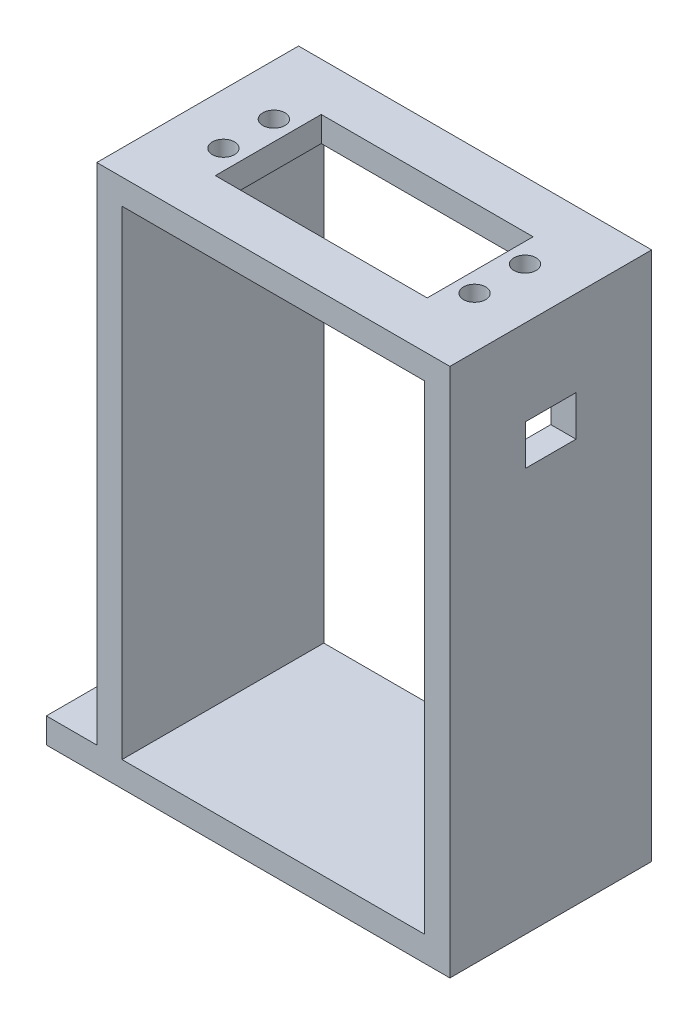
ISO-10303-21;
HEADER;
FILE_DESCRIPTION(('STEP AP214'),'2;1');
FILE_NAME('part.step','',(''),(''),'','','');
FILE_SCHEMA(('AUTOMOTIVE_DESIGN { 1 0 10303 214 1 1 1 1 }'));
ENDSEC;
DATA;
#1=APPLICATION_CONTEXT('core data for automotive mechanical design processes');
#2=APPLICATION_PROTOCOL_DEFINITION('international standard','automotive_design',2000,#1);
#3=PRODUCT_CONTEXT('',#1,'mechanical');
#4=PRODUCT('Part','Part','',(#3));
#5=PRODUCT_RELATED_PRODUCT_CATEGORY('part','',(#4));
#6=PRODUCT_DEFINITION_FORMATION('','',#4);
#7=PRODUCT_DEFINITION_CONTEXT('part definition',#1,'design');
#8=PRODUCT_DEFINITION('design','',#6,#7);
#9=PRODUCT_DEFINITION_SHAPE('','',#8);
#10=(LENGTH_UNIT() NAMED_UNIT(*) SI_UNIT(.MILLI.,.METRE.));
#11=(NAMED_UNIT(*) PLANE_ANGLE_UNIT() SI_UNIT($,.RADIAN.));
#12=(NAMED_UNIT(*) SI_UNIT($,.STERADIAN.) SOLID_ANGLE_UNIT());
#13=UNCERTAINTY_MEASURE_WITH_UNIT(LENGTH_MEASURE(1.E-05),#10,'distance_accuracy_value','');
#14=(GEOMETRIC_REPRESENTATION_CONTEXT(3) GLOBAL_UNCERTAINTY_ASSIGNED_CONTEXT((#13)) GLOBAL_UNIT_ASSIGNED_CONTEXT((#10,
#11,#12)) REPRESENTATION_CONTEXT('',''));
#15=CARTESIAN_POINT('',(0.,0.,0.));
#16=DIRECTION('',(0.,0.,1.));
#17=DIRECTION('',(1.,0.,0.));
#18=AXIS2_PLACEMENT_3D('',#15,#16,#17);
#19=CARTESIAN_POINT('',(-75.,5.,-25.));
#20=DIRECTION('',(0.,-1.,0.));
#21=DIRECTION('',(0.,0.,-1.));
#22=AXIS2_PLACEMENT_3D('',#19,#20,#21);
#23=CYLINDRICAL_SURFACE('',#22,2.2);
#24=CARTESIAN_POINT('',(-75.,5.,-25.));
#25=DIRECTION('',(0.,1.,0.));
#26=DIRECTION('',(0.,0.,1.));
#27=AXIS2_PLACEMENT_3D('',#24,#25,#26);
#28=CIRCLE('',#27,2.2);
#29=CARTESIAN_POINT('',(-75.,5.,-22.8));
#30=VERTEX_POINT('',#29);
#31=EDGE_CURVE('E263',#30,#30,#28,.T.);
#32=ORIENTED_EDGE('',*,*,#31,.T.);
#33=EDGE_LOOP('',(#32));
#34=FACE_BOUND('',#33,.T.);
#35=CARTESIAN_POINT('',(-75.,3.,-25.));
#36=DIRECTION('',(0.,-1.,0.));
#37=DIRECTION('',(0.,0.,-1.));
#38=AXIS2_PLACEMENT_3D('',#35,#36,#37);
#39=CIRCLE('',#38,2.2);
#40=CARTESIAN_POINT('',(-75.,3.,-27.2));
#41=VERTEX_POINT('',#40);
#42=EDGE_CURVE('E424',#41,#41,#39,.T.);
#43=ORIENTED_EDGE('',*,*,#42,.T.);
#44=EDGE_LOOP('',(#43));
#45=FACE_BOUND('',#44,.T.);
#46=ADVANCED_FACE('F40',(#34,#45),#23,.F.);
#47=CARTESIAN_POINT('',(-75.,5.,-15.));
#48=DIRECTION('',(0.,-1.,0.));
#49=DIRECTION('',(0.,0.,-1.));
#50=AXIS2_PLACEMENT_3D('',#47,#48,#49);
#51=CYLINDRICAL_SURFACE('',#50,2.2);
#52=CARTESIAN_POINT('',(-75.,5.,-15.));
#53=DIRECTION('',(0.,1.,0.));
#54=DIRECTION('',(0.,0.,1.));
#55=AXIS2_PLACEMENT_3D('',#52,#53,#54);
#56=CIRCLE('',#55,2.2);
#57=CARTESIAN_POINT('',(-75.,5.,-12.8));
#58=VERTEX_POINT('',#57);
#59=EDGE_CURVE('E260',#58,#58,#56,.T.);
#60=ORIENTED_EDGE('',*,*,#59,.T.);
#61=EDGE_LOOP('',(#60));
#62=FACE_BOUND('',#61,.T.);
#63=CARTESIAN_POINT('',(-75.,3.,-15.));
#64=DIRECTION('',(0.,-1.,0.));
#65=DIRECTION('',(0.,0.,-1.));
#66=AXIS2_PLACEMENT_3D('',#63,#64,#65);
#67=CIRCLE('',#66,2.2);
#68=CARTESIAN_POINT('',(-75.,3.,-17.2));
#69=VERTEX_POINT('',#68);
#70=EDGE_CURVE('E427',#69,#69,#67,.T.);
#71=ORIENTED_EDGE('',*,*,#70,.T.);
#72=EDGE_LOOP('',(#71));
#73=FACE_BOUND('',#72,.T.);
#74=ADVANCED_FACE('F397',(#62,#73),#51,.F.);
#75=CARTESIAN_POINT('',(0.,5.,0.));
#76=DIRECTION('',(-1.,0.,0.));
#77=DIRECTION('',(0.,0.,1.));
#78=AXIS2_PLACEMENT_3D('',#75,#76,#77);
#79=PLANE('',#78);
#80=DIRECTION('',(0.,0.,-1.));
#81=VECTOR('',#80,1.);
#82=CARTESIAN_POINT('',(0.,0.,0.));
#83=LINE('',#82,#81);
#84=CARTESIAN_POINT('',(0.,0.,0.));
#85=VERTEX_POINT('',#84);
#86=CARTESIAN_POINT('',(0.,0.,-40.));
#87=VERTEX_POINT('',#86);
#88=EDGE_CURVE('E266',#85,#87,#83,.T.);
#89=ORIENTED_EDGE('',*,*,#88,.T.);
#90=DIRECTION('',(0.,-1.,0.));
#91=VECTOR('',#90,1.);
#92=CARTESIAN_POINT('',(0.,5.,-40.));
#93=LINE('',#92,#91);
#94=CARTESIAN_POINT('',(0.,105.,-40.));
#95=VERTEX_POINT('',#94);
#96=EDGE_CURVE('E294',#95,#87,#93,.T.);
#97=ORIENTED_EDGE('',*,*,#96,.F.);
#98=DIRECTION('',(0.,0.,-1.));
#99=VECTOR('',#98,1.);
#100=CARTESIAN_POINT('',(0.,105.,0.));
#101=LINE('',#100,#99);
#102=CARTESIAN_POINT('',(0.,105.,0.));
#103=VERTEX_POINT('',#102);
#104=EDGE_CURVE('E249',#103,#95,#101,.T.);
#105=ORIENTED_EDGE('',*,*,#104,.F.);
#106=DIRECTION('',(0.,-1.,0.));
#107=VECTOR('',#106,1.);
#108=CARTESIAN_POINT('',(0.,5.,0.));
#109=LINE('',#108,#107);
#110=EDGE_CURVE('E277',#103,#85,#109,.T.);
#111=ORIENTED_EDGE('',*,*,#110,.T.);
#112=EDGE_LOOP('',(#89,#97,#105,#111));
#113=FACE_BOUND('',#112,.T.);
#114=DIRECTION('',(0.,-1.,0.));
#115=VECTOR('',#114,1.);
#116=CARTESIAN_POINT('',(0.,0.,-25.));
#117=LINE('',#116,#115);
#118=CARTESIAN_POINT('',(0.,88.,-25.));
#119=VERTEX_POINT('',#118);
#120=CARTESIAN_POINT('',(0.,80.,-25.));
#121=VERTEX_POINT('',#120);
#122=EDGE_CURVE('E207',#119,#121,#117,.T.);
#123=ORIENTED_EDGE('',*,*,#122,.T.);
#124=DIRECTION('',(0.,0.,-1.));
#125=VECTOR('',#124,1.);
#126=CARTESIAN_POINT('',(0.,80.,0.));
#127=LINE('',#126,#125);
#128=CARTESIAN_POINT('',(0.,80.,-15.));
#129=VERTEX_POINT('',#128);
#130=EDGE_CURVE('E216',#129,#121,#127,.T.);
#131=ORIENTED_EDGE('',*,*,#130,.F.);
#132=DIRECTION('',(0.,-1.,0.));
#133=VECTOR('',#132,1.);
#134=CARTESIAN_POINT('',(0.,0.,-15.));
#135=LINE('',#134,#133);
#136=CARTESIAN_POINT('',(0.,88.,-15.));
#137=VERTEX_POINT('',#136);
#138=EDGE_CURVE('E213',#137,#129,#135,.T.);
#139=ORIENTED_EDGE('',*,*,#138,.F.);
#140=DIRECTION('',(0.,0.,-1.));
#141=VECTOR('',#140,1.);
#142=CARTESIAN_POINT('',(0.,88.,0.));
#143=LINE('',#142,#141);
#144=EDGE_CURVE('E210',#137,#119,#143,.T.);
#145=ORIENTED_EDGE('',*,*,#144,.T.);
#146=EDGE_LOOP('',(#123,#131,#139,#145));
#147=FACE_BOUND('',#146,.T.);
#148=ADVANCED_FACE('F42',(#113,#147),#79,.F.);
#149=CARTESIAN_POINT('',(-5.,105.,0.));
#150=DIRECTION('',(-1.,0.,0.));
#151=DIRECTION('',(0.,0.,1.));
#152=AXIS2_PLACEMENT_3D('',#149,#150,#151);
#153=PLANE('',#152);
#154=DIRECTION('',(0.,0.,1.));
#155=VECTOR('',#154,1.);
#156=CARTESIAN_POINT('',(-5.,100.,0.));
#157=LINE('',#156,#155);
#158=CARTESIAN_POINT('',(-5.,100.,-40.));
#159=VERTEX_POINT('',#158);
#160=CARTESIAN_POINT('',(-5.,100.,0.));
#161=VERTEX_POINT('',#160);
#162=EDGE_CURVE('E204',#159,#161,#157,.T.);
#163=ORIENTED_EDGE('',*,*,#162,.F.);
#164=DIRECTION('',(0.,-1.,0.));
#165=VECTOR('',#164,1.);
#166=CARTESIAN_POINT('',(-5.,105.,-40.));
#167=LINE('',#166,#165);
#168=CARTESIAN_POINT('',(-5.,5.,-40.));
#169=VERTEX_POINT('',#168);
#170=EDGE_CURVE('E254',#159,#169,#167,.T.);
#171=ORIENTED_EDGE('',*,*,#170,.T.);
#172=DIRECTION('',(0.,0.,-1.));
#173=VECTOR('',#172,1.);
#174=CARTESIAN_POINT('',(-5.,5.,0.));
#175=LINE('',#174,#173);
#176=CARTESIAN_POINT('',(-5.,5.,0.));
#177=VERTEX_POINT('',#176);
#178=EDGE_CURVE('E245',#177,#169,#175,.T.);
#179=ORIENTED_EDGE('',*,*,#178,.F.);
#180=DIRECTION('',(0.,-1.,0.));
#181=VECTOR('',#180,1.);
#182=CARTESIAN_POINT('',(-5.,105.,0.));
#183=LINE('',#182,#181);
#184=EDGE_CURVE('E258',#161,#177,#183,.T.);
#185=ORIENTED_EDGE('',*,*,#184,.F.);
#186=EDGE_LOOP('',(#163,#171,#179,#185));
#187=FACE_BOUND('',#186,.T.);
#188=DIRECTION('',(0.,0.,1.));
#189=VECTOR('',#188,1.);
#190=CARTESIAN_POINT('',(-5.,80.,0.));
#191=LINE('',#190,#189);
#192=CARTESIAN_POINT('',(-5.,80.,-25.));
#193=VERTEX_POINT('',#192);
#194=CARTESIAN_POINT('',(-5.,80.,-15.));
#195=VERTEX_POINT('',#194);
#196=EDGE_CURVE('E302',#193,#195,#191,.T.);
#197=ORIENTED_EDGE('',*,*,#196,.F.);
#198=DIRECTION('',(0.,1.,0.));
#199=VECTOR('',#198,1.);
#200=CARTESIAN_POINT('',(-5.,105.,-25.));
#201=LINE('',#200,#199);
#202=CARTESIAN_POINT('',(-5.,88.,-25.));
#203=VERTEX_POINT('',#202);
#204=EDGE_CURVE('E304',#193,#203,#201,.T.);
#205=ORIENTED_EDGE('',*,*,#204,.T.);
#206=DIRECTION('',(0.,0.,1.));
#207=VECTOR('',#206,1.);
#208=CARTESIAN_POINT('',(-5.,88.,0.));
#209=LINE('',#208,#207);
#210=CARTESIAN_POINT('',(-5.,88.,-15.));
#211=VERTEX_POINT('',#210);
#212=EDGE_CURVE('E296',#203,#211,#209,.T.);
#213=ORIENTED_EDGE('',*,*,#212,.T.);
#214=DIRECTION('',(0.,1.,0.));
#215=VECTOR('',#214,1.);
#216=CARTESIAN_POINT('',(-5.,105.,-15.));
#217=LINE('',#216,#215);
#218=EDGE_CURVE('E299',#195,#211,#217,.T.);
#219=ORIENTED_EDGE('',*,*,#218,.F.);
#220=EDGE_LOOP('',(#197,#205,#213,#219));
#221=FACE_BOUND('',#220,.T.);
#222=ADVANCED_FACE('F356',(#187,#221),#153,.T.);
#223=CARTESIAN_POINT('',(0.,5.,0.));
#224=DIRECTION('',(0.,1.,0.));
#225=DIRECTION('',(0.,0.,1.));
#226=AXIS2_PLACEMENT_3D('',#223,#224,#225);
#227=PLANE('',#226);
#228=DIRECTION('',(-1.,0.,0.));
#229=VECTOR('',#228,1.);
#230=CARTESIAN_POINT('',(0.,5.,-40.));
#231=LINE('',#230,#229);
#232=CARTESIAN_POINT('',(-65.,5.,-40.));
#233=VERTEX_POINT('',#232);
#234=EDGE_CURVE('E267',#169,#233,#231,.T.);
#235=ORIENTED_EDGE('',*,*,#234,.T.);
#236=DIRECTION('',(0.,0.,-1.));
#237=VECTOR('',#236,1.);
#238=CARTESIAN_POINT('',(-65.,5.,0.));
#239=LINE('',#238,#237);
#240=CARTESIAN_POINT('',(-65.,5.,0.));
#241=VERTEX_POINT('',#240);
#242=EDGE_CURVE('E222',#241,#233,#239,.T.);
#243=ORIENTED_EDGE('',*,*,#242,.F.);
#244=DIRECTION('',(1.,0.,0.));
#245=VECTOR('',#244,1.);
#246=CARTESIAN_POINT('',(0.,5.,0.));
#247=LINE('',#246,#245);
#248=EDGE_CURVE('E273',#241,#177,#247,.T.);
#249=ORIENTED_EDGE('',*,*,#248,.T.);
#250=ORIENTED_EDGE('',*,*,#178,.T.);
#251=EDGE_LOOP('',(#235,#243,#249,#250));
#252=FACE_BOUND('',#251,.T.);
#253=ADVANCED_FACE('F353',(#252),#227,.T.);
#254=DIRECTION('',(0.,0.,-1.));
#255=VECTOR('',#254,1.);
#256=CARTESIAN_POINT('',(-70.,5.,0.));
#257=LINE('',#256,#255);
#258=CARTESIAN_POINT('',(-70.,5.,0.));
#259=VERTEX_POINT('',#258);
#260=CARTESIAN_POINT('',(-70.,5.,-40.));
#261=VERTEX_POINT('',#260);
#262=EDGE_CURVE('E233',#259,#261,#257,.T.);
#263=ORIENTED_EDGE('',*,*,#262,.T.);
#264=CARTESIAN_POINT('',(-80.,5.,-40.));
#265=VERTEX_POINT('',#264);
#266=EDGE_CURVE('E271',#261,#265,#231,.T.);
#267=ORIENTED_EDGE('',*,*,#266,.T.);
#268=DIRECTION('',(0.,0.,1.));
#269=VECTOR('',#268,1.);
#270=CARTESIAN_POINT('',(-80.,5.,0.));
#271=LINE('',#270,#269);
#272=CARTESIAN_POINT('',(-80.,5.,0.));
#273=VERTEX_POINT('',#272);
#274=EDGE_CURVE('E270',#265,#273,#271,.T.);
#275=ORIENTED_EDGE('',*,*,#274,.T.);
#276=EDGE_CURVE('E274',#273,#259,#247,.T.);
#277=ORIENTED_EDGE('',*,*,#276,.T.);
#278=EDGE_LOOP('',(#263,#267,#275,#277));
#279=FACE_BOUND('',#278,.T.);
#280=ORIENTED_EDGE('',*,*,#31,.F.);
#281=EDGE_LOOP('',(#280));
#282=FACE_BOUND('',#281,.T.);
#283=ORIENTED_EDGE('',*,*,#59,.F.);
#284=EDGE_LOOP('',(#283));
#285=FACE_BOUND('',#284,.T.);
#286=ADVANCED_FACE('F385',(#279,#282,#285),#227,.T.);
#287=CARTESIAN_POINT('',(0.,0.,0.));
#288=DIRECTION('',(0.,1.,0.));
#289=DIRECTION('',(0.,0.,1.));
#290=AXIS2_PLACEMENT_3D('',#287,#288,#289);
#291=PLANE('',#290);
#292=CARTESIAN_POINT('',(-75.,0.,-15.));
#293=DIRECTION('',(0.,-1.,0.));
#294=DIRECTION('',(0.,0.,-1.));
#295=AXIS2_PLACEMENT_3D('',#292,#293,#294);
#296=CIRCLE('',#295,4.00000000000001);
#297=CARTESIAN_POINT('',(-75.,0.,-19.));
#298=VERTEX_POINT('',#297);
#299=EDGE_CURVE('E418',#298,#298,#296,.T.);
#300=ORIENTED_EDGE('',*,*,#299,.F.);
#301=EDGE_LOOP('',(#300));
#302=FACE_BOUND('',#301,.T.);
#303=CARTESIAN_POINT('',(-75.,0.,-25.));
#304=DIRECTION('',(0.,-1.,0.));
#305=DIRECTION('',(0.,0.,-1.));
#306=AXIS2_PLACEMENT_3D('',#303,#304,#305);
#307=CIRCLE('',#306,4.00000000000001);
#308=CARTESIAN_POINT('',(-75.,0.,-29.));
#309=VERTEX_POINT('',#308);
#310=EDGE_CURVE('E421',#309,#309,#307,.T.);
#311=ORIENTED_EDGE('',*,*,#310,.F.);
#312=EDGE_LOOP('',(#311));
#313=FACE_BOUND('',#312,.T.);
#314=ORIENTED_EDGE('',*,*,#88,.F.);
#315=DIRECTION('',(1.,0.,0.));
#316=VECTOR('',#315,1.);
#317=CARTESIAN_POINT('',(0.,0.,0.));
#318=LINE('',#317,#316);
#319=CARTESIAN_POINT('',(-80.,0.,0.));
#320=VERTEX_POINT('',#319);
#321=EDGE_CURVE('E284',#320,#85,#318,.T.);
#322=ORIENTED_EDGE('',*,*,#321,.F.);
#323=DIRECTION('',(0.,0.,1.));
#324=VECTOR('',#323,1.);
#325=CARTESIAN_POINT('',(-80.,0.,0.));
#326=LINE('',#325,#324);
#327=CARTESIAN_POINT('',(-80.,0.,-40.));
#328=VERTEX_POINT('',#327);
#329=EDGE_CURVE('E282',#328,#320,#326,.T.);
#330=ORIENTED_EDGE('',*,*,#329,.F.);
#331=DIRECTION('',(-1.,0.,0.));
#332=VECTOR('',#331,1.);
#333=CARTESIAN_POINT('',(0.,0.,-40.));
#334=LINE('',#333,#332);
#335=EDGE_CURVE('E280',#87,#328,#334,.T.);
#336=ORIENTED_EDGE('',*,*,#335,.F.);
#337=EDGE_LOOP('',(#314,#322,#330,#336));
#338=FACE_BOUND('',#337,.T.);
#339=ADVANCED_FACE('F371',(#302,#313,#338),#291,.F.);
#340=CARTESIAN_POINT('',(0.,5.,-40.));
#341=DIRECTION('',(0.,0.,1.));
#342=DIRECTION('',(1.,0.,0.));
#343=AXIS2_PLACEMENT_3D('',#340,#341,#342);
#344=PLANE('',#343);
#345=ORIENTED_EDGE('',*,*,#170,.F.);
#346=DIRECTION('',(1.,0.,0.));
#347=VECTOR('',#346,1.);
#348=CARTESIAN_POINT('',(-70.,100.,-40.));
#349=LINE('',#348,#347);
#350=CARTESIAN_POINT('',(-65.,100.,-40.));
#351=VERTEX_POINT('',#350);
#352=EDGE_CURVE('E195',#351,#159,#349,.T.);
#353=ORIENTED_EDGE('',*,*,#352,.F.);
#354=DIRECTION('',(0.,-1.,0.));
#355=VECTOR('',#354,1.);
#356=CARTESIAN_POINT('',(-65.,105.,-40.));
#357=LINE('',#356,#355);
#358=EDGE_CURVE('E241',#351,#233,#357,.T.);
#359=ORIENTED_EDGE('',*,*,#358,.T.);
#360=ORIENTED_EDGE('',*,*,#234,.F.);
#361=EDGE_LOOP('',(#345,#353,#359,#360));
#362=FACE_BOUND('',#361,.T.);
#363=ORIENTED_EDGE('',*,*,#266,.F.);
#364=DIRECTION('',(0.,-1.,0.));
#365=VECTOR('',#364,1.);
#366=CARTESIAN_POINT('',(-70.,105.,-40.));
#367=LINE('',#366,#365);
#368=CARTESIAN_POINT('',(-70.,105.,-40.));
#369=VERTEX_POINT('',#368);
#370=EDGE_CURVE('E239',#369,#261,#367,.T.);
#371=ORIENTED_EDGE('',*,*,#370,.F.);
#372=DIRECTION('',(-1.,0.,0.));
#373=VECTOR('',#372,1.);
#374=CARTESIAN_POINT('',(0.,105.,-40.));
#375=LINE('',#374,#373);
#376=EDGE_CURVE('E252',#95,#369,#375,.T.);
#377=ORIENTED_EDGE('',*,*,#376,.F.);
#378=ORIENTED_EDGE('',*,*,#96,.T.);
#379=ORIENTED_EDGE('',*,*,#335,.T.);
#380=DIRECTION('',(0.,-1.,0.));
#381=VECTOR('',#380,1.);
#382=CARTESIAN_POINT('',(-80.,5.,-40.));
#383=LINE('',#382,#381);
#384=EDGE_CURVE('E291',#265,#328,#383,.T.);
#385=ORIENTED_EDGE('',*,*,#384,.F.);
#386=EDGE_LOOP('',(#363,#371,#377,#378,#379,#385));
#387=FACE_BOUND('',#386,.T.);
#388=ADVANCED_FACE('F343',(#362,#387),#344,.F.);
#389=CARTESIAN_POINT('',(-80.,5.,0.));
#390=DIRECTION('',(1.,0.,0.));
#391=DIRECTION('',(0.,0.,-1.));
#392=AXIS2_PLACEMENT_3D('',#389,#390,#391);
#393=PLANE('',#392);
#394=ORIENTED_EDGE('',*,*,#329,.T.);
#395=DIRECTION('',(0.,-1.,0.));
#396=VECTOR('',#395,1.);
#397=CARTESIAN_POINT('',(-80.,5.,0.));
#398=LINE('',#397,#396);
#399=EDGE_CURVE('E288',#273,#320,#398,.T.);
#400=ORIENTED_EDGE('',*,*,#399,.F.);
#401=ORIENTED_EDGE('',*,*,#274,.F.);
#402=ORIENTED_EDGE('',*,*,#384,.T.);
#403=EDGE_LOOP('',(#394,#400,#401,#402));
#404=FACE_BOUND('',#403,.T.);
#405=ADVANCED_FACE('F362',(#404),#393,.F.);
#406=CARTESIAN_POINT('',(0.,5.,0.));
#407=DIRECTION('',(0.,0.,-1.));
#408=DIRECTION('',(-1.,0.,0.));
#409=AXIS2_PLACEMENT_3D('',#406,#407,#408);
#410=PLANE('',#409);
#411=DIRECTION('',(1.,0.,0.));
#412=VECTOR('',#411,1.);
#413=CARTESIAN_POINT('',(-70.,100.,0.));
#414=LINE('',#413,#412);
#415=CARTESIAN_POINT('',(-65.,100.,0.));
#416=VERTEX_POINT('',#415);
#417=EDGE_CURVE('E199',#416,#161,#414,.T.);
#418=ORIENTED_EDGE('',*,*,#417,.T.);
#419=ORIENTED_EDGE('',*,*,#184,.T.);
#420=ORIENTED_EDGE('',*,*,#248,.F.);
#421=DIRECTION('',(0.,-1.,0.));
#422=VECTOR('',#421,1.);
#423=CARTESIAN_POINT('',(-65.,105.,0.));
#424=LINE('',#423,#422);
#425=EDGE_CURVE('E243',#416,#241,#424,.T.);
#426=ORIENTED_EDGE('',*,*,#425,.F.);
#427=EDGE_LOOP('',(#418,#419,#420,#426));
#428=FACE_BOUND('',#427,.T.);
#429=ORIENTED_EDGE('',*,*,#321,.T.);
#430=ORIENTED_EDGE('',*,*,#110,.F.);
#431=DIRECTION('',(1.,0.,0.));
#432=VECTOR('',#431,1.);
#433=CARTESIAN_POINT('',(0.,105.,0.));
#434=LINE('',#433,#432);
#435=CARTESIAN_POINT('',(-70.,105.,0.));
#436=VERTEX_POINT('',#435);
#437=EDGE_CURVE('E246',#436,#103,#434,.T.);
#438=ORIENTED_EDGE('',*,*,#437,.F.);
#439=DIRECTION('',(0.,-1.,0.));
#440=VECTOR('',#439,1.);
#441=CARTESIAN_POINT('',(-70.,105.,0.));
#442=LINE('',#441,#440);
#443=EDGE_CURVE('E232',#436,#259,#442,.T.);
#444=ORIENTED_EDGE('',*,*,#443,.T.);
#445=ORIENTED_EDGE('',*,*,#276,.F.);
#446=ORIENTED_EDGE('',*,*,#399,.T.);
#447=EDGE_LOOP('',(#429,#430,#438,#444,#445,#446));
#448=FACE_BOUND('',#447,.T.);
#449=ADVANCED_FACE('F359',(#428,#448),#410,.F.);
#450=CARTESIAN_POINT('',(0.,105.,0.));
#451=DIRECTION('',(0.,1.,0.));
#452=DIRECTION('',(0.,0.,1.));
#453=AXIS2_PLACEMENT_3D('',#450,#451,#452);
#454=PLANE('',#453);
#455=CARTESIAN_POINT('',(-10.11,105.,-25.));
#456=DIRECTION('',(0.,1.,0.));
#457=DIRECTION('',(0.,0.,-1.));
#458=AXIS2_PLACEMENT_3D('',#455,#456,#457);
#459=CIRCLE('',#458,2.2);
#460=CARTESIAN_POINT('',(-10.11,105.,-27.2));
#461=VERTEX_POINT('',#460);
#462=EDGE_CURVE('E441',#461,#461,#459,.T.);
#463=ORIENTED_EDGE('',*,*,#462,.F.);
#464=EDGE_LOOP('',(#463));
#465=FACE_BOUND('',#464,.T.);
#466=CARTESIAN_POINT('',(-10.11,105.,-15.));
#467=DIRECTION('',(0.,1.,0.));
#468=DIRECTION('',(0.,0.,-1.));
#469=AXIS2_PLACEMENT_3D('',#466,#467,#468);
#470=CIRCLE('',#469,2.2);
#471=CARTESIAN_POINT('',(-10.11,105.,-17.2));
#472=VERTEX_POINT('',#471);
#473=EDGE_CURVE('E438',#472,#472,#470,.T.);
#474=ORIENTED_EDGE('',*,*,#473,.F.);
#475=EDGE_LOOP('',(#474));
#476=FACE_BOUND('',#475,.T.);
#477=CARTESIAN_POINT('',(-59.89,105.,-15.));
#478=DIRECTION('',(0.,1.,0.));
#479=DIRECTION('',(0.,0.,1.));
#480=AXIS2_PLACEMENT_3D('',#477,#478,#479);
#481=CIRCLE('',#480,2.2);
#482=CARTESIAN_POINT('',(-59.89,105.,-12.8));
#483=VERTEX_POINT('',#482);
#484=EDGE_CURVE('E435',#483,#483,#481,.T.);
#485=ORIENTED_EDGE('',*,*,#484,.F.);
#486=EDGE_LOOP('',(#485));
#487=FACE_BOUND('',#486,.T.);
#488=CARTESIAN_POINT('',(-59.89,105.,-25.));
#489=DIRECTION('',(0.,1.,0.));
#490=DIRECTION('',(0.,0.,1.));
#491=AXIS2_PLACEMENT_3D('',#488,#489,#490);
#492=CIRCLE('',#491,2.2);
#493=CARTESIAN_POINT('',(-59.89,105.,-22.8));
#494=VERTEX_POINT('',#493);
#495=EDGE_CURVE('E432',#494,#494,#492,.T.);
#496=ORIENTED_EDGE('',*,*,#495,.F.);
#497=EDGE_LOOP('',(#496));
#498=FACE_BOUND('',#497,.T.);
#499=DIRECTION('',(0.,0.,-1.));
#500=VECTOR('',#499,1.);
#501=CARTESIAN_POINT('',(-14.,105.,-9.49999999999999));
#502=LINE('',#501,#500);
#503=CARTESIAN_POINT('',(-14.,105.,-9.49999999999999));
#504=VERTEX_POINT('',#503);
#505=CARTESIAN_POINT('',(-14.,105.,-30.5));
#506=VERTEX_POINT('',#505);
#507=EDGE_CURVE('E57',#504,#506,#502,.T.);
#508=ORIENTED_EDGE('',*,*,#507,.F.);
#509=DIRECTION('',(1.,0.,0.));
#510=VECTOR('',#509,1.);
#511=CARTESIAN_POINT('',(-14.,105.,-9.49999999999999));
#512=LINE('',#511,#510);
#513=CARTESIAN_POINT('',(-56.,105.,-9.49999999999999));
#514=VERTEX_POINT('',#513);
#515=EDGE_CURVE('E185',#514,#504,#512,.T.);
#516=ORIENTED_EDGE('',*,*,#515,.F.);
#517=DIRECTION('',(0.,0.,1.));
#518=VECTOR('',#517,1.);
#519=CARTESIAN_POINT('',(-56.,105.,-9.49999999999999));
#520=LINE('',#519,#518);
#521=CARTESIAN_POINT('',(-56.,105.,-30.5));
#522=VERTEX_POINT('',#521);
#523=EDGE_CURVE('E169',#522,#514,#520,.T.);
#524=ORIENTED_EDGE('',*,*,#523,.F.);
#525=DIRECTION('',(-1.,0.,0.));
#526=VECTOR('',#525,1.);
#527=CARTESIAN_POINT('',(-14.,105.,-30.5));
#528=LINE('',#527,#526);
#529=EDGE_CURVE('E178',#506,#522,#528,.T.);
#530=ORIENTED_EDGE('',*,*,#529,.F.);
#531=EDGE_LOOP('',(#508,#516,#524,#530));
#532=FACE_BOUND('',#531,.T.);
#533=ORIENTED_EDGE('',*,*,#376,.T.);
#534=DIRECTION('',(0.,0.,-1.));
#535=VECTOR('',#534,1.);
#536=CARTESIAN_POINT('',(-70.,105.,0.));
#537=LINE('',#536,#535);
#538=EDGE_CURVE('E229',#436,#369,#537,.T.);
#539=ORIENTED_EDGE('',*,*,#538,.F.);
#540=ORIENTED_EDGE('',*,*,#437,.T.);
#541=ORIENTED_EDGE('',*,*,#104,.T.);
#542=EDGE_LOOP('',(#533,#539,#540,#541));
#543=FACE_BOUND('',#542,.T.);
#544=ADVANCED_FACE('F182',(#465,#476,#487,#498,#532,#543),#454,.T.);
#545=CARTESIAN_POINT('',(-65.,105.,0.));
#546=DIRECTION('',(-1.,0.,0.));
#547=DIRECTION('',(0.,0.,1.));
#548=AXIS2_PLACEMENT_3D('',#545,#546,#547);
#549=PLANE('',#548);
#550=ORIENTED_EDGE('',*,*,#358,.F.);
#551=DIRECTION('',(0.,0.,1.));
#552=VECTOR('',#551,1.);
#553=CARTESIAN_POINT('',(-65.,100.,0.));
#554=LINE('',#553,#552);
#555=EDGE_CURVE('E198',#351,#416,#554,.T.);
#556=ORIENTED_EDGE('',*,*,#555,.T.);
#557=ORIENTED_EDGE('',*,*,#425,.T.);
#558=ORIENTED_EDGE('',*,*,#242,.T.);
#559=EDGE_LOOP('',(#550,#556,#557,#558));
#560=FACE_BOUND('',#559,.T.);
#561=ADVANCED_FACE('F347',(#560),#549,.F.);
#562=CARTESIAN_POINT('',(-70.,105.,0.));
#563=DIRECTION('',(-1.,0.,0.));
#564=DIRECTION('',(0.,0.,1.));
#565=AXIS2_PLACEMENT_3D('',#562,#563,#564);
#566=PLANE('',#565);
#567=ORIENTED_EDGE('',*,*,#262,.F.);
#568=ORIENTED_EDGE('',*,*,#443,.F.);
#569=ORIENTED_EDGE('',*,*,#538,.T.);
#570=ORIENTED_EDGE('',*,*,#370,.T.);
#571=EDGE_LOOP('',(#567,#568,#569,#570));
#572=FACE_BOUND('',#571,.T.);
#573=ADVANCED_FACE('F383',(#572),#566,.T.);
#574=CARTESIAN_POINT('',(-10.,0.,-25.));
#575=DIRECTION('',(0.,0.,1.));
#576=DIRECTION('',(1.,0.,0.));
#577=AXIS2_PLACEMENT_3D('',#574,#575,#576);
#578=PLANE('',#577);
#579=DIRECTION('',(1.,0.,0.));
#580=VECTOR('',#579,1.);
#581=CARTESIAN_POINT('',(-10.,80.,-25.));
#582=LINE('',#581,#580);
#583=EDGE_CURVE('E220',#193,#121,#582,.T.);
#584=ORIENTED_EDGE('',*,*,#583,.T.);
#585=ORIENTED_EDGE('',*,*,#122,.F.);
#586=DIRECTION('',(1.,0.,0.));
#587=VECTOR('',#586,1.);
#588=CARTESIAN_POINT('',(-10.,88.,-25.));
#589=LINE('',#588,#587);
#590=EDGE_CURVE('E219',#203,#119,#589,.T.);
#591=ORIENTED_EDGE('',*,*,#590,.F.);
#592=ORIENTED_EDGE('',*,*,#204,.F.);
#593=EDGE_LOOP('',(#584,#585,#591,#592));
#594=FACE_BOUND('',#593,.T.);
#595=ADVANCED_FACE('F500',(#594),#578,.T.);
#596=CARTESIAN_POINT('',(-10.,80.,0.));
#597=DIRECTION('',(0.,-1.,0.));
#598=DIRECTION('',(0.,0.,-1.));
#599=AXIS2_PLACEMENT_3D('',#596,#597,#598);
#600=PLANE('',#599);
#601=ORIENTED_EDGE('',*,*,#196,.T.);
#602=DIRECTION('',(1.,0.,0.));
#603=VECTOR('',#602,1.);
#604=CARTESIAN_POINT('',(-10.,80.,-15.));
#605=LINE('',#604,#603);
#606=EDGE_CURVE('E223',#195,#129,#605,.T.);
#607=ORIENTED_EDGE('',*,*,#606,.T.);
#608=ORIENTED_EDGE('',*,*,#130,.T.);
#609=ORIENTED_EDGE('',*,*,#583,.F.);
#610=EDGE_LOOP('',(#601,#607,#608,#609));
#611=FACE_BOUND('',#610,.T.);
#612=ADVANCED_FACE('F496',(#611),#600,.F.);
#613=CARTESIAN_POINT('',(-10.,0.,-15.));
#614=DIRECTION('',(0.,0.,1.));
#615=DIRECTION('',(0.,-1.,0.));
#616=AXIS2_PLACEMENT_3D('',#613,#614,#615);
#617=PLANE('',#616);
#618=ORIENTED_EDGE('',*,*,#218,.T.);
#619=DIRECTION('',(1.,0.,0.));
#620=VECTOR('',#619,1.);
#621=CARTESIAN_POINT('',(-10.,88.,-15.));
#622=LINE('',#621,#620);
#623=EDGE_CURVE('E225',#211,#137,#622,.T.);
#624=ORIENTED_EDGE('',*,*,#623,.T.);
#625=ORIENTED_EDGE('',*,*,#138,.T.);
#626=ORIENTED_EDGE('',*,*,#606,.F.);
#627=EDGE_LOOP('',(#618,#624,#625,#626));
#628=FACE_BOUND('',#627,.T.);
#629=ADVANCED_FACE('F499',(#628),#617,.F.);
#630=CARTESIAN_POINT('',(-10.,88.,0.));
#631=DIRECTION('',(0.,-1.,0.));
#632=DIRECTION('',(0.,0.,-1.));
#633=AXIS2_PLACEMENT_3D('',#630,#631,#632);
#634=PLANE('',#633);
#635=ORIENTED_EDGE('',*,*,#590,.T.);
#636=ORIENTED_EDGE('',*,*,#144,.F.);
#637=ORIENTED_EDGE('',*,*,#623,.F.);
#638=ORIENTED_EDGE('',*,*,#212,.F.);
#639=EDGE_LOOP('',(#635,#636,#637,#638));
#640=FACE_BOUND('',#639,.T.);
#641=ADVANCED_FACE('F329',(#640),#634,.T.);
#642=CARTESIAN_POINT('',(-70.,100.,0.));
#643=DIRECTION('',(0.,-1.,0.));
#644=DIRECTION('',(0.,0.,-1.));
#645=AXIS2_PLACEMENT_3D('',#642,#643,#644);
#646=PLANE('',#645);
#647=CARTESIAN_POINT('',(-10.11,100.,-25.));
#648=DIRECTION('',(0.,-1.,0.));
#649=DIRECTION('',(0.,0.,-1.));
#650=AXIS2_PLACEMENT_3D('',#647,#648,#649);
#651=CIRCLE('',#650,2.2);
#652=CARTESIAN_POINT('',(-10.11,100.,-27.2));
#653=VERTEX_POINT('',#652);
#654=EDGE_CURVE('E44',#653,#653,#651,.T.);
#655=ORIENTED_EDGE('',*,*,#654,.F.);
#656=EDGE_LOOP('',(#655));
#657=FACE_BOUND('',#656,.T.);
#658=CARTESIAN_POINT('',(-10.11,100.,-15.));
#659=DIRECTION('',(0.,-1.,0.));
#660=DIRECTION('',(0.,0.,-1.));
#661=AXIS2_PLACEMENT_3D('',#658,#659,#660);
#662=CIRCLE('',#661,2.2);
#663=CARTESIAN_POINT('',(-10.11,100.,-17.2));
#664=VERTEX_POINT('',#663);
#665=EDGE_CURVE('E315',#664,#664,#662,.T.);
#666=ORIENTED_EDGE('',*,*,#665,.F.);
#667=EDGE_LOOP('',(#666));
#668=FACE_BOUND('',#667,.T.);
#669=CARTESIAN_POINT('',(-59.89,100.,-15.));
#670=DIRECTION('',(0.,-1.,0.));
#671=DIRECTION('',(0.,0.,-1.));
#672=AXIS2_PLACEMENT_3D('',#669,#670,#671);
#673=CIRCLE('',#672,2.2);
#674=CARTESIAN_POINT('',(-59.89,100.,-17.2));
#675=VERTEX_POINT('',#674);
#676=EDGE_CURVE('E313',#675,#675,#673,.T.);
#677=ORIENTED_EDGE('',*,*,#676,.F.);
#678=EDGE_LOOP('',(#677));
#679=FACE_BOUND('',#678,.T.);
#680=CARTESIAN_POINT('',(-59.89,100.,-25.));
#681=DIRECTION('',(0.,-1.,0.));
#682=DIRECTION('',(0.,0.,-1.));
#683=AXIS2_PLACEMENT_3D('',#680,#681,#682);
#684=CIRCLE('',#683,2.2);
#685=CARTESIAN_POINT('',(-59.89,100.,-27.2));
#686=VERTEX_POINT('',#685);
#687=EDGE_CURVE('E192',#686,#686,#684,.T.);
#688=ORIENTED_EDGE('',*,*,#687,.F.);
#689=EDGE_LOOP('',(#688));
#690=FACE_BOUND('',#689,.T.);
#691=DIRECTION('',(0.,0.,1.));
#692=VECTOR('',#691,1.);
#693=CARTESIAN_POINT('',(-14.,100.,0.));
#694=LINE('',#693,#692);
#695=CARTESIAN_POINT('',(-14.,100.,-30.5));
#696=VERTEX_POINT('',#695);
#697=CARTESIAN_POINT('',(-14.,100.,-9.49999999999999));
#698=VERTEX_POINT('',#697);
#699=EDGE_CURVE('E11',#696,#698,#694,.T.);
#700=ORIENTED_EDGE('',*,*,#699,.F.);
#701=DIRECTION('',(1.,0.,0.));
#702=VECTOR('',#701,1.);
#703=CARTESIAN_POINT('',(-70.,100.,-30.5));
#704=LINE('',#703,#702);
#705=CARTESIAN_POINT('',(-56.,100.,-30.5));
#706=VERTEX_POINT('',#705);
#707=EDGE_CURVE('E307',#706,#696,#704,.T.);
#708=ORIENTED_EDGE('',*,*,#707,.F.);
#709=DIRECTION('',(0.,0.,-1.));
#710=VECTOR('',#709,1.);
#711=CARTESIAN_POINT('',(-56.,100.,0.));
#712=LINE('',#711,#710);
#713=CARTESIAN_POINT('',(-56.,100.,-9.49999999999999));
#714=VERTEX_POINT('',#713);
#715=EDGE_CURVE('E172',#714,#706,#712,.T.);
#716=ORIENTED_EDGE('',*,*,#715,.F.);
#717=DIRECTION('',(-1.,0.,0.));
#718=VECTOR('',#717,1.);
#719=CARTESIAN_POINT('',(-70.,100.,-9.49999999999999));
#720=LINE('',#719,#718);
#721=EDGE_CURVE('E49',#698,#714,#720,.T.);
#722=ORIENTED_EDGE('',*,*,#721,.F.);
#723=EDGE_LOOP('',(#700,#708,#716,#722));
#724=FACE_BOUND('',#723,.T.);
#725=ORIENTED_EDGE('',*,*,#352,.T.);
#726=ORIENTED_EDGE('',*,*,#162,.T.);
#727=ORIENTED_EDGE('',*,*,#417,.F.);
#728=ORIENTED_EDGE('',*,*,#555,.F.);
#729=EDGE_LOOP('',(#725,#726,#727,#728));
#730=FACE_BOUND('',#729,.T.);
#731=ADVANCED_FACE('F325',(#657,#668,#679,#690,#724,#730),#646,.T.);
#732=CARTESIAN_POINT('',(-14.,35.,-9.49999999999999));
#733=DIRECTION('',(1.,0.,0.));
#734=DIRECTION('',(0.,0.,-1.));
#735=AXIS2_PLACEMENT_3D('',#732,#733,#734);
#736=PLANE('',#735);
#737=ORIENTED_EDGE('',*,*,#699,.T.);
#738=DIRECTION('',(0.,1.,0.));
#739=VECTOR('',#738,1.);
#740=CARTESIAN_POINT('',(-14.,35.,-9.49999999999999));
#741=LINE('',#740,#739);
#742=EDGE_CURVE('E190',#698,#504,#741,.T.);
#743=ORIENTED_EDGE('',*,*,#742,.T.);
#744=ORIENTED_EDGE('',*,*,#507,.T.);
#745=DIRECTION('',(0.,1.,0.));
#746=VECTOR('',#745,1.);
#747=CARTESIAN_POINT('',(-14.,35.,-30.5));
#748=LINE('',#747,#746);
#749=EDGE_CURVE('E175',#696,#506,#748,.T.);
#750=ORIENTED_EDGE('',*,*,#749,.F.);
#751=EDGE_LOOP('',(#737,#743,#744,#750));
#752=FACE_BOUND('',#751,.T.);
#753=ADVANCED_FACE('F328',(#752),#736,.F.);
#754=CARTESIAN_POINT('',(-14.,35.,-9.49999999999999));
#755=DIRECTION('',(0.,0.,1.));
#756=DIRECTION('',(1.,0.,0.));
#757=AXIS2_PLACEMENT_3D('',#754,#755,#756);
#758=PLANE('',#757);
#759=ORIENTED_EDGE('',*,*,#721,.T.);
#760=DIRECTION('',(0.,1.,0.));
#761=VECTOR('',#760,1.);
#762=CARTESIAN_POINT('',(-56.,35.,-9.49999999999999));
#763=LINE('',#762,#761);
#764=EDGE_CURVE('E174',#714,#514,#763,.T.);
#765=ORIENTED_EDGE('',*,*,#764,.T.);
#766=ORIENTED_EDGE('',*,*,#515,.T.);
#767=ORIENTED_EDGE('',*,*,#742,.F.);
#768=EDGE_LOOP('',(#759,#765,#766,#767));
#769=FACE_BOUND('',#768,.T.);
#770=ADVANCED_FACE('F486',(#769),#758,.F.);
#771=CARTESIAN_POINT('',(-56.,35.,-9.49999999999999));
#772=DIRECTION('',(-1.,0.,0.));
#773=DIRECTION('',(0.,0.,1.));
#774=AXIS2_PLACEMENT_3D('',#771,#772,#773);
#775=PLANE('',#774);
#776=ORIENTED_EDGE('',*,*,#715,.T.);
#777=DIRECTION('',(0.,1.,0.));
#778=VECTOR('',#777,1.);
#779=CARTESIAN_POINT('',(-56.,35.,-30.5));
#780=LINE('',#779,#778);
#781=EDGE_CURVE('E65',#706,#522,#780,.T.);
#782=ORIENTED_EDGE('',*,*,#781,.T.);
#783=ORIENTED_EDGE('',*,*,#523,.T.);
#784=ORIENTED_EDGE('',*,*,#764,.F.);
#785=EDGE_LOOP('',(#776,#782,#783,#784));
#786=FACE_BOUND('',#785,.T.);
#787=ADVANCED_FACE('F166',(#786),#775,.F.);
#788=CARTESIAN_POINT('',(-14.,35.,-30.5));
#789=DIRECTION('',(0.,0.,-1.));
#790=DIRECTION('',(-1.,0.,0.));
#791=AXIS2_PLACEMENT_3D('',#788,#789,#790);
#792=PLANE('',#791);
#793=ORIENTED_EDGE('',*,*,#707,.T.);
#794=ORIENTED_EDGE('',*,*,#749,.T.);
#795=ORIENTED_EDGE('',*,*,#529,.T.);
#796=ORIENTED_EDGE('',*,*,#781,.F.);
#797=EDGE_LOOP('',(#793,#794,#795,#796));
#798=FACE_BOUND('',#797,.T.);
#799=ADVANCED_FACE('F179',(#798),#792,.F.);
#800=CARTESIAN_POINT('',(-59.89,35.,-25.));
#801=DIRECTION('',(0.,1.,0.));
#802=DIRECTION('',(0.,0.,1.));
#803=AXIS2_PLACEMENT_3D('',#800,#801,#802);
#804=CYLINDRICAL_SURFACE('',#803,2.2);
#805=ORIENTED_EDGE('',*,*,#687,.T.);
#806=EDGE_LOOP('',(#805));
#807=FACE_BOUND('',#806,.T.);
#808=ORIENTED_EDGE('',*,*,#495,.T.);
#809=EDGE_LOOP('',(#808));
#810=FACE_BOUND('',#809,.T.);
#811=ADVANCED_FACE('F473',(#807,#810),#804,.F.);
#812=CARTESIAN_POINT('',(-59.89,35.,-15.));
#813=DIRECTION('',(0.,1.,0.));
#814=DIRECTION('',(0.,0.,1.));
#815=AXIS2_PLACEMENT_3D('',#812,#813,#814);
#816=CYLINDRICAL_SURFACE('',#815,2.2);
#817=ORIENTED_EDGE('',*,*,#676,.T.);
#818=EDGE_LOOP('',(#817));
#819=FACE_BOUND('',#818,.T.);
#820=ORIENTED_EDGE('',*,*,#484,.T.);
#821=EDGE_LOOP('',(#820));
#822=FACE_BOUND('',#821,.T.);
#823=ADVANCED_FACE('F476',(#819,#822),#816,.F.);
#824=CARTESIAN_POINT('',(-10.11,35.,-15.));
#825=DIRECTION('',(0.,1.,0.));
#826=DIRECTION('',(0.,0.,1.));
#827=AXIS2_PLACEMENT_3D('',#824,#825,#826);
#828=CYLINDRICAL_SURFACE('',#827,2.2);
#829=ORIENTED_EDGE('',*,*,#665,.T.);
#830=EDGE_LOOP('',(#829));
#831=FACE_BOUND('',#830,.T.);
#832=ORIENTED_EDGE('',*,*,#473,.T.);
#833=EDGE_LOOP('',(#832));
#834=FACE_BOUND('',#833,.T.);
#835=ADVANCED_FACE('F480',(#831,#834),#828,.F.);
#836=CARTESIAN_POINT('',(-10.11,35.,-25.));
#837=DIRECTION('',(0.,1.,0.));
#838=DIRECTION('',(0.,0.,1.));
#839=AXIS2_PLACEMENT_3D('',#836,#837,#838);
#840=CYLINDRICAL_SURFACE('',#839,2.2);
#841=ORIENTED_EDGE('',*,*,#654,.T.);
#842=EDGE_LOOP('',(#841));
#843=FACE_BOUND('',#842,.T.);
#844=ORIENTED_EDGE('',*,*,#462,.T.);
#845=EDGE_LOOP('',(#844));
#846=FACE_BOUND('',#845,.T.);
#847=ADVANCED_FACE('F322',(#843,#846),#840,.F.);
#848=CARTESIAN_POINT('',(-75.,3.,-15.));
#849=DIRECTION('',(0.,-1.,0.));
#850=DIRECTION('',(0.,0.,-1.));
#851=AXIS2_PLACEMENT_3D('',#848,#849,#850);
#852=CYLINDRICAL_SURFACE('',#851,4.00000000000001);
#853=CARTESIAN_POINT('',(-75.,3.,-15.));
#854=DIRECTION('',(0.,-1.,0.));
#855=DIRECTION('',(0.,0.,-1.));
#856=AXIS2_PLACEMENT_3D('',#853,#854,#855);
#857=CIRCLE('',#856,4.00000000000001);
#858=CARTESIAN_POINT('',(-75.,3.,-19.));
#859=VERTEX_POINT('',#858);
#860=EDGE_CURVE('E443',#859,#859,#857,.T.);
#861=ORIENTED_EDGE('',*,*,#860,.F.);
#862=EDGE_LOOP('',(#861));
#863=FACE_BOUND('',#862,.T.);
#864=ORIENTED_EDGE('',*,*,#299,.T.);
#865=EDGE_LOOP('',(#864));
#866=FACE_BOUND('',#865,.T.);
#867=ADVANCED_FACE('F458',(#863,#866),#852,.F.);
#868=CARTESIAN_POINT('',(-75.,3.,-15.));
#869=DIRECTION('',(0.,-1.,0.));
#870=DIRECTION('',(0.,0.,-1.));
#871=AXIS2_PLACEMENT_3D('',#868,#869,#870);
#872=PLANE('',#871);
#873=ORIENTED_EDGE('',*,*,#70,.F.);
#874=EDGE_LOOP('',(#873));
#875=FACE_BOUND('',#874,.T.);
#876=ORIENTED_EDGE('',*,*,#860,.T.);
#877=EDGE_LOOP('',(#876));
#878=FACE_BOUND('',#877,.T.);
#879=ADVANCED_FACE('F455',(#875,#878),#872,.T.);
#880=CARTESIAN_POINT('',(-75.,3.,-25.));
#881=DIRECTION('',(0.,-1.,0.));
#882=DIRECTION('',(0.,0.,-1.));
#883=AXIS2_PLACEMENT_3D('',#880,#881,#882);
#884=CYLINDRICAL_SURFACE('',#883,4.00000000000001);
#885=CARTESIAN_POINT('',(-75.,3.,-25.));
#886=DIRECTION('',(0.,-1.,0.));
#887=DIRECTION('',(0.,0.,-1.));
#888=AXIS2_PLACEMENT_3D('',#885,#886,#887);
#889=CIRCLE('',#888,4.00000000000001);
#890=CARTESIAN_POINT('',(-75.,3.,-29.));
#891=VERTEX_POINT('',#890);
#892=EDGE_CURVE('E423',#891,#891,#889,.T.);
#893=ORIENTED_EDGE('',*,*,#892,.F.);
#894=EDGE_LOOP('',(#893));
#895=FACE_BOUND('',#894,.T.);
#896=ORIENTED_EDGE('',*,*,#310,.T.);
#897=EDGE_LOOP('',(#896));
#898=FACE_BOUND('',#897,.T.);
#899=ADVANCED_FACE('F457',(#895,#898),#884,.F.);
#900=CARTESIAN_POINT('',(-75.,3.,-25.));
#901=DIRECTION('',(0.,-1.,0.));
#902=DIRECTION('',(0.,0.,-1.));
#903=AXIS2_PLACEMENT_3D('',#900,#901,#902);
#904=PLANE('',#903);
#905=ORIENTED_EDGE('',*,*,#42,.F.);
#906=EDGE_LOOP('',(#905));
#907=FACE_BOUND('',#906,.T.);
#908=ORIENTED_EDGE('',*,*,#892,.T.);
#909=EDGE_LOOP('',(#908));
#910=FACE_BOUND('',#909,.T.);
#911=ADVANCED_FACE('F464',(#907,#910),#904,.T.);
#912=CLOSED_SHELL('',(#46,#74,#148,#222,#253,#286,#339,#388,#405,#449,#544,#561,#573,#595,#612,
#629,#641,#731,#753,#770,#787,#799,#811,#823,#835,#847,#867,#879,#899,#911));
#913=MANIFOLD_SOLID_BREP('B2',#912);
#914=ADVANCED_BREP_SHAPE_REPRESENTATION('',(#18,#913),#14);
#915=SHAPE_DEFINITION_REPRESENTATION(#9,#914);
ENDSEC;
END-ISO-10303-21;
